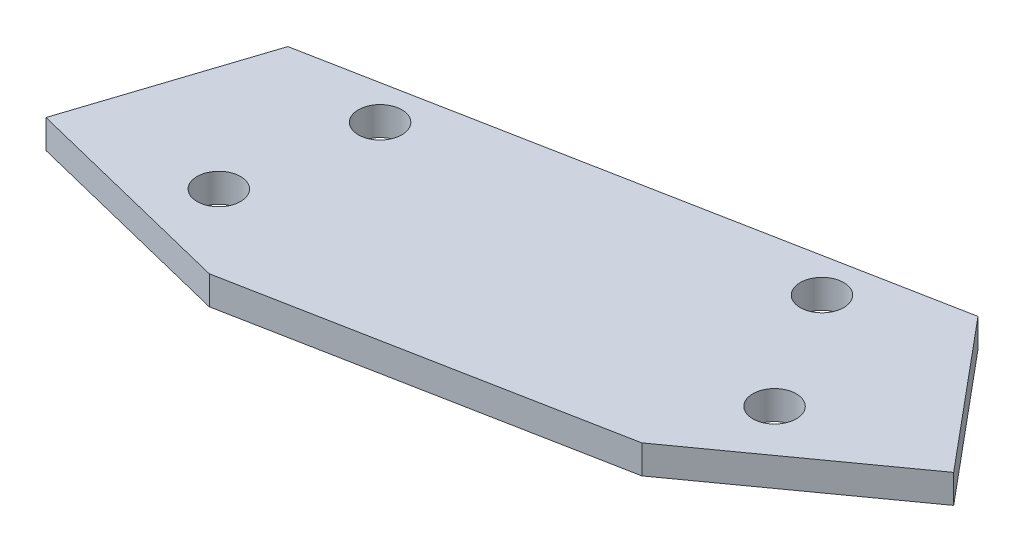
ISO-10303-21;
HEADER;
FILE_DESCRIPTION(('STEP AP214'),'2;1');
FILE_NAME('part.step','',(''),(''),'','','');
FILE_SCHEMA(('AUTOMOTIVE_DESIGN { 1 0 10303 214 1 1 1 1 }'));
ENDSEC;
DATA;
#1=APPLICATION_CONTEXT('core data for automotive mechanical design processes');
#2=APPLICATION_PROTOCOL_DEFINITION('international standard','automotive_design',2000,#1);
#3=PRODUCT_CONTEXT('',#1,'mechanical');
#4=PRODUCT('Part','Part','',(#3));
#5=PRODUCT_RELATED_PRODUCT_CATEGORY('part','',(#4));
#6=PRODUCT_DEFINITION_FORMATION('','',#4);
#7=PRODUCT_DEFINITION_CONTEXT('part definition',#1,'design');
#8=PRODUCT_DEFINITION('design','',#6,#7);
#9=PRODUCT_DEFINITION_SHAPE('','',#8);
#10=(LENGTH_UNIT() NAMED_UNIT(*) SI_UNIT(.MILLI.,.METRE.));
#11=(NAMED_UNIT(*) PLANE_ANGLE_UNIT() SI_UNIT($,.RADIAN.));
#12=(NAMED_UNIT(*) SI_UNIT($,.STERADIAN.) SOLID_ANGLE_UNIT());
#13=UNCERTAINTY_MEASURE_WITH_UNIT(LENGTH_MEASURE(1.E-05),#10,'distance_accuracy_value','');
#14=(GEOMETRIC_REPRESENTATION_CONTEXT(3) GLOBAL_UNCERTAINTY_ASSIGNED_CONTEXT((#13)) GLOBAL_UNIT_ASSIGNED_CONTEXT((#10,
#11,#12)) REPRESENTATION_CONTEXT('',''));
#15=CARTESIAN_POINT('',(0.,0.,0.));
#16=DIRECTION('',(0.,0.,1.));
#17=DIRECTION('',(1.,0.,0.));
#18=AXIS2_PLACEMENT_3D('',#15,#16,#17);
#19=CARTESIAN_POINT('',(0.,2.,0.));
#20=DIRECTION('',(0.,1.,0.));
#21=DIRECTION('',(0.,0.,1.));
#22=AXIS2_PLACEMENT_3D('',#19,#20,#21);
#23=PLANE('',#22);
#24=CARTESIAN_POINT('',(150.849906033684,2.,-17.2786141740151));
#25=DIRECTION('',(0.,1.,0.));
#26=DIRECTION('',(0.,0.,1.));
#27=AXIS2_PLACEMENT_3D('',#24,#25,#26);
#28=CIRCLE('',#27,1.51999999999999);
#29=CARTESIAN_POINT('',(150.849906033684,2.,-15.7586141740151));
#30=VERTEX_POINT('',#29);
#31=EDGE_CURVE('E195',#30,#30,#28,.T.);
#32=ORIENTED_EDGE('',*,*,#31,.F.);
#33=EDGE_LOOP('',(#32));
#34=FACE_BOUND('',#33,.T.);
#35=CARTESIAN_POINT('',(124.942788746776,2.,-12.2924783071056));
#36=DIRECTION('',(0.,1.,0.));
#37=DIRECTION('',(0.,0.,1.));
#38=AXIS2_PLACEMENT_3D('',#35,#36,#37);
#39=CIRCLE('',#38,1.51999999999996);
#40=CARTESIAN_POINT('',(124.942788746776,2.,-10.7724783071057));
#41=VERTEX_POINT('',#40);
#42=EDGE_CURVE('E128',#41,#41,#39,.T.);
#43=ORIENTED_EDGE('',*,*,#42,.F.);
#44=EDGE_LOOP('',(#43));
#45=FACE_BOUND('',#44,.T.);
#46=DIRECTION('',(-0.310146416397832,0.,0.950688803129385));
#47=VECTOR('',#46,1.);
#48=CARTESIAN_POINT('',(112.97357635398,2.,-0.902501231946934));
#49=LINE('',#48,#47);
#50=CARTESIAN_POINT('',(117.133278722941,2.,-13.6531965727238));
#51=VERTEX_POINT('',#50);
#52=CARTESIAN_POINT('',(112.97357635398,2.,-0.902501231946934));
#53=VERTEX_POINT('',#52);
#54=EDGE_CURVE('E135',#51,#53,#49,.T.);
#55=ORIENTED_EDGE('',*,*,#54,.T.);
#56=DIRECTION('',(0.970739827228978,0.,0.240133687414854));
#57=VECTOR('',#56,1.);
#58=CARTESIAN_POINT('',(128.142526141823,2.,2.84986963467687));
#59=LINE('',#58,#57);
#60=CARTESIAN_POINT('',(128.142526141823,2.,2.84986963467687));
#61=VERTEX_POINT('',#60);
#62=EDGE_CURVE('E93',#53,#61,#59,.T.);
#63=ORIENTED_EDGE('',*,*,#62,.T.);
#64=DIRECTION('',(0.981978333734859,0.,-0.188993523897807));
#65=VECTOR('',#64,1.);
#66=CARTESIAN_POINT('',(153.499211008062,2.,-2.03032890189353));
#67=LINE('',#66,#65);
#68=CARTESIAN_POINT('',(153.499211008062,2.,-2.03032890189353));
#69=VERTEX_POINT('',#68);
#70=EDGE_CURVE('E106',#61,#69,#67,.T.);
#71=ORIENTED_EDGE('',*,*,#70,.T.);
#72=DIRECTION('',(0.812261341145016,0.,-0.583293677045534));
#73=VECTOR('',#72,1.);
#74=CARTESIAN_POINT('',(166.191748341783,2.,-11.1449775961032));
#75=LINE('',#74,#73);
#76=CARTESIAN_POINT('',(166.191748341783,2.,-11.1449775961032));
#77=VERTEX_POINT('',#76);
#78=EDGE_CURVE('E100',#69,#77,#75,.T.);
#79=ORIENTED_EDGE('',*,*,#78,.T.);
#80=DIRECTION('',(-0.640862458670028,0.,-0.767655723008307));
#81=VECTOR('',#80,1.);
#82=CARTESIAN_POINT('',(157.596462545901,2.,-21.4408222704729));
#83=LINE('',#82,#81);
#84=CARTESIAN_POINT('',(157.596462545901,2.,-21.4408222704729));
#85=VERTEX_POINT('',#84);
#86=EDGE_CURVE('E104',#77,#85,#83,.T.);
#87=ORIENTED_EDGE('',*,*,#86,.T.);
#88=DIRECTION('',(-0.981978333699997,0.,0.188993524078939));
#89=VECTOR('',#88,1.);
#90=CARTESIAN_POINT('',(117.133278722941,2.,-13.6531965727238));
#91=LINE('',#90,#89);
#92=EDGE_CURVE('E56',#85,#51,#91,.T.);
#93=ORIENTED_EDGE('',*,*,#92,.T.);
#94=EDGE_LOOP('',(#55,#63,#71,#79,#87,#93));
#95=FACE_BOUND('',#94,.T.);
#96=CARTESIAN_POINT('',(123.343028663491,2.,-2.614316013658));
#97=DIRECTION('',(0.,1.,0.));
#98=DIRECTION('',(0.,0.,1.));
#99=AXIS2_PLACEMENT_3D('',#96,#97,#98);
#100=CIRCLE('',#99,1.52);
#101=CARTESIAN_POINT('',(123.343028663491,2.,-1.09431601365799));
#102=VERTEX_POINT('',#101);
#103=EDGE_CURVE('E201',#102,#102,#100,.T.);
#104=ORIENTED_EDGE('',*,*,#103,.F.);
#105=EDGE_LOOP('',(#104));
#106=FACE_BOUND('',#105,.T.);
#107=CARTESIAN_POINT('',(155.927676671118,2.,-8.88562286840841));
#108=DIRECTION('',(0.,1.,0.));
#109=DIRECTION('',(0.,0.,1.));
#110=AXIS2_PLACEMENT_3D('',#107,#108,#109);
#111=CIRCLE('',#110,1.52000000000002);
#112=CARTESIAN_POINT('',(155.927676671118,2.,-7.36562286840839));
#113=VERTEX_POINT('',#112);
#114=EDGE_CURVE('E186',#113,#113,#111,.T.);
#115=ORIENTED_EDGE('',*,*,#114,.F.);
#116=EDGE_LOOP('',(#115));
#117=FACE_BOUND('',#116,.T.);
#118=ADVANCED_FACE('F39',(#34,#45,#95,#106,#117),#23,.T.);
#119=CARTESIAN_POINT('',(0.,0.,0.));
#120=DIRECTION('',(0.,1.,0.));
#121=DIRECTION('',(0.,0.,1.));
#122=AXIS2_PLACEMENT_3D('',#119,#120,#121);
#123=PLANE('',#122);
#124=DIRECTION('',(-0.310146416397832,0.,0.950688803129385));
#125=VECTOR('',#124,1.);
#126=CARTESIAN_POINT('',(112.97357635398,0.,-0.902501231946934));
#127=LINE('',#126,#125);
#128=CARTESIAN_POINT('',(117.133278722941,0.,-13.6531965727238));
#129=VERTEX_POINT('',#128);
#130=CARTESIAN_POINT('',(112.97357635398,0.,-0.902501231946934));
#131=VERTEX_POINT('',#130);
#132=EDGE_CURVE('E124',#129,#131,#127,.T.);
#133=ORIENTED_EDGE('',*,*,#132,.F.);
#134=DIRECTION('',(-0.981978333699997,0.,0.188993524078939));
#135=VECTOR('',#134,1.);
#136=CARTESIAN_POINT('',(117.133278722941,0.,-13.6531965727238));
#137=LINE('',#136,#135);
#138=CARTESIAN_POINT('',(157.596462545901,0.,-21.4408222704729));
#139=VERTEX_POINT('',#138);
#140=EDGE_CURVE('E85',#139,#129,#137,.T.);
#141=ORIENTED_EDGE('',*,*,#140,.F.);
#142=DIRECTION('',(-0.640862458670028,0.,-0.767655723008307));
#143=VECTOR('',#142,1.);
#144=CARTESIAN_POINT('',(157.596462545901,0.,-21.4408222704729));
#145=LINE('',#144,#143);
#146=CARTESIAN_POINT('',(166.191748341783,0.,-11.1449775961032));
#147=VERTEX_POINT('',#146);
#148=EDGE_CURVE('E79',#147,#139,#145,.T.);
#149=ORIENTED_EDGE('',*,*,#148,.F.);
#150=DIRECTION('',(0.812261341145016,0.,-0.583293677045534));
#151=VECTOR('',#150,1.);
#152=CARTESIAN_POINT('',(166.191748341783,0.,-11.1449775961032));
#153=LINE('',#152,#151);
#154=CARTESIAN_POINT('',(153.499211008062,0.,-2.03032890189353));
#155=VERTEX_POINT('',#154);
#156=EDGE_CURVE('E114',#155,#147,#153,.T.);
#157=ORIENTED_EDGE('',*,*,#156,.F.);
#158=DIRECTION('',(0.981978333734859,0.,-0.188993523897807));
#159=VECTOR('',#158,1.);
#160=CARTESIAN_POINT('',(153.499211008062,0.,-2.03032890189353));
#161=LINE('',#160,#159);
#162=CARTESIAN_POINT('',(128.142526141823,0.,2.84986963467687));
#163=VERTEX_POINT('',#162);
#164=EDGE_CURVE('E130',#163,#155,#161,.T.);
#165=ORIENTED_EDGE('',*,*,#164,.F.);
#166=DIRECTION('',(0.970739827228978,0.,0.240133687414854));
#167=VECTOR('',#166,1.);
#168=CARTESIAN_POINT('',(128.142526141823,0.,2.84986963467687));
#169=LINE('',#168,#167);
#170=EDGE_CURVE('E127',#131,#163,#169,.T.);
#171=ORIENTED_EDGE('',*,*,#170,.F.);
#172=EDGE_LOOP('',(#133,#141,#149,#157,#165,#171));
#173=FACE_BOUND('',#172,.T.);
#174=CARTESIAN_POINT('',(124.942788746776,0.,-12.2924783071056));
#175=DIRECTION('',(0.,1.,0.));
#176=DIRECTION('',(0.,0.,1.));
#177=AXIS2_PLACEMENT_3D('',#174,#175,#176);
#178=CIRCLE('',#177,1.51999999999996);
#179=CARTESIAN_POINT('',(124.942788746776,0.,-10.7724783071057));
#180=VERTEX_POINT('',#179);
#181=EDGE_CURVE('E204',#180,#180,#178,.T.);
#182=ORIENTED_EDGE('',*,*,#181,.T.);
#183=EDGE_LOOP('',(#182));
#184=FACE_BOUND('',#183,.T.);
#185=CARTESIAN_POINT('',(123.343028663491,0.,-2.614316013658));
#186=DIRECTION('',(0.,1.,0.));
#187=DIRECTION('',(0.,0.,1.));
#188=AXIS2_PLACEMENT_3D('',#185,#186,#187);
#189=CIRCLE('',#188,1.52);
#190=CARTESIAN_POINT('',(123.343028663491,0.,-1.09431601365799));
#191=VERTEX_POINT('',#190);
#192=EDGE_CURVE('E198',#191,#191,#189,.T.);
#193=ORIENTED_EDGE('',*,*,#192,.T.);
#194=EDGE_LOOP('',(#193));
#195=FACE_BOUND('',#194,.T.);
#196=CARTESIAN_POINT('',(150.849906033684,0.,-17.2786141740151));
#197=DIRECTION('',(0.,1.,0.));
#198=DIRECTION('',(0.,0.,1.));
#199=AXIS2_PLACEMENT_3D('',#196,#197,#198);
#200=CIRCLE('',#199,1.51999999999999);
#201=CARTESIAN_POINT('',(150.849906033684,0.,-15.7586141740151));
#202=VERTEX_POINT('',#201);
#203=EDGE_CURVE('E192',#202,#202,#200,.T.);
#204=ORIENTED_EDGE('',*,*,#203,.T.);
#205=EDGE_LOOP('',(#204));
#206=FACE_BOUND('',#205,.T.);
#207=CARTESIAN_POINT('',(155.927676671118,0.,-8.88562286840841));
#208=DIRECTION('',(0.,1.,0.));
#209=DIRECTION('',(0.,0.,1.));
#210=AXIS2_PLACEMENT_3D('',#207,#208,#209);
#211=CIRCLE('',#210,1.52000000000002);
#212=CARTESIAN_POINT('',(155.927676671118,0.,-7.36562286840839));
#213=VERTEX_POINT('',#212);
#214=EDGE_CURVE('E189',#213,#213,#211,.T.);
#215=ORIENTED_EDGE('',*,*,#214,.T.);
#216=EDGE_LOOP('',(#215));
#217=FACE_BOUND('',#216,.T.);
#218=ADVANCED_FACE('F144',(#173,#184,#195,#206,#217),#123,.F.);
#219=CARTESIAN_POINT('',(112.97357635398,2.,-0.902501231946934));
#220=DIRECTION('',(0.950688803129385,0.,0.310146416397832));
#221=DIRECTION('',(0.310146416397832,0.,-0.950688803129385));
#222=AXIS2_PLACEMENT_3D('',#219,#220,#221);
#223=PLANE('',#222);
#224=ORIENTED_EDGE('',*,*,#132,.T.);
#225=DIRECTION('',(0.,-1.,0.));
#226=VECTOR('',#225,1.);
#227=CARTESIAN_POINT('',(112.97357635398,2.,-0.902501231946934));
#228=LINE('',#227,#226);
#229=EDGE_CURVE('E11',#53,#131,#228,.T.);
#230=ORIENTED_EDGE('',*,*,#229,.F.);
#231=ORIENTED_EDGE('',*,*,#54,.F.);
#232=DIRECTION('',(0.,-1.,0.));
#233=VECTOR('',#232,1.);
#234=CARTESIAN_POINT('',(117.133278722941,2.,-13.6531965727238));
#235=LINE('',#234,#233);
#236=EDGE_CURVE('E120',#51,#129,#235,.T.);
#237=ORIENTED_EDGE('',*,*,#236,.T.);
#238=EDGE_LOOP('',(#224,#230,#231,#237));
#239=FACE_BOUND('',#238,.T.);
#240=ADVANCED_FACE('F41',(#239),#223,.F.);
#241=CARTESIAN_POINT('',(128.142526141823,2.,2.84986963467687));
#242=DIRECTION('',(0.240133687414854,0.,-0.970739827228978));
#243=DIRECTION('',(-0.970739827228978,0.,-0.240133687414854));
#244=AXIS2_PLACEMENT_3D('',#241,#242,#243);
#245=PLANE('',#244);
#246=ORIENTED_EDGE('',*,*,#170,.T.);
#247=DIRECTION('',(0.,-1.,0.));
#248=VECTOR('',#247,1.);
#249=CARTESIAN_POINT('',(128.142526141823,2.,2.84986963467687));
#250=LINE('',#249,#248);
#251=EDGE_CURVE('E48',#61,#163,#250,.T.);
#252=ORIENTED_EDGE('',*,*,#251,.F.);
#253=ORIENTED_EDGE('',*,*,#62,.F.);
#254=ORIENTED_EDGE('',*,*,#229,.T.);
#255=EDGE_LOOP('',(#246,#252,#253,#254));
#256=FACE_BOUND('',#255,.T.);
#257=ADVANCED_FACE('F266',(#256),#245,.F.);
#258=CARTESIAN_POINT('',(153.499211008062,2.,-2.03032890189353));
#259=DIRECTION('',(-0.188993523897806,0.,-0.981978333734858));
#260=DIRECTION('',(-0.981978333734859,0.,0.188993523897807));
#261=AXIS2_PLACEMENT_3D('',#258,#259,#260);
#262=PLANE('',#261);
#263=ORIENTED_EDGE('',*,*,#164,.T.);
#264=DIRECTION('',(0.,-1.,0.));
#265=VECTOR('',#264,1.);
#266=CARTESIAN_POINT('',(153.499211008062,2.,-2.03032890189353));
#267=LINE('',#266,#265);
#268=EDGE_CURVE('E115',#69,#155,#267,.T.);
#269=ORIENTED_EDGE('',*,*,#268,.F.);
#270=ORIENTED_EDGE('',*,*,#70,.F.);
#271=ORIENTED_EDGE('',*,*,#251,.T.);
#272=EDGE_LOOP('',(#263,#269,#270,#271));
#273=FACE_BOUND('',#272,.T.);
#274=ADVANCED_FACE('F141',(#273),#262,.F.);
#275=CARTESIAN_POINT('',(166.191748341783,2.,-11.1449775961032));
#276=DIRECTION('',(-0.583293677045534,0.,-0.812261341145016));
#277=DIRECTION('',(-0.812261341145016,0.,0.583293677045534));
#278=AXIS2_PLACEMENT_3D('',#275,#276,#277);
#279=PLANE('',#278);
#280=ORIENTED_EDGE('',*,*,#156,.T.);
#281=DIRECTION('',(0.,-1.,0.));
#282=VECTOR('',#281,1.);
#283=CARTESIAN_POINT('',(166.191748341783,2.,-11.1449775961032));
#284=LINE('',#283,#282);
#285=EDGE_CURVE('E111',#77,#147,#284,.T.);
#286=ORIENTED_EDGE('',*,*,#285,.F.);
#287=ORIENTED_EDGE('',*,*,#78,.F.);
#288=ORIENTED_EDGE('',*,*,#268,.T.);
#289=EDGE_LOOP('',(#280,#286,#287,#288));
#290=FACE_BOUND('',#289,.T.);
#291=ADVANCED_FACE('F112',(#290),#279,.F.);
#292=CARTESIAN_POINT('',(157.596462545901,2.,-21.4408222704729));
#293=DIRECTION('',(-0.767655723008307,0.,0.640862458670028));
#294=DIRECTION('',(0.640862458670028,0.,0.767655723008307));
#295=AXIS2_PLACEMENT_3D('',#292,#293,#294);
#296=PLANE('',#295);
#297=ORIENTED_EDGE('',*,*,#148,.T.);
#298=DIRECTION('',(0.,-1.,0.));
#299=VECTOR('',#298,1.);
#300=CARTESIAN_POINT('',(157.596462545901,2.,-21.4408222704729));
#301=LINE('',#300,#299);
#302=EDGE_CURVE('E116',#85,#139,#301,.T.);
#303=ORIENTED_EDGE('',*,*,#302,.F.);
#304=ORIENTED_EDGE('',*,*,#86,.F.);
#305=ORIENTED_EDGE('',*,*,#285,.T.);
#306=EDGE_LOOP('',(#297,#303,#304,#305));
#307=FACE_BOUND('',#306,.T.);
#308=ADVANCED_FACE('F118',(#307),#296,.F.);
#309=CARTESIAN_POINT('',(117.133278722941,2.,-13.6531965727238));
#310=DIRECTION('',(0.188993524078939,0.,0.981978333699997));
#311=DIRECTION('',(0.981978333699997,0.,-0.188993524078939));
#312=AXIS2_PLACEMENT_3D('',#309,#310,#311);
#313=PLANE('',#312);
#314=ORIENTED_EDGE('',*,*,#140,.T.);
#315=ORIENTED_EDGE('',*,*,#236,.F.);
#316=ORIENTED_EDGE('',*,*,#92,.F.);
#317=ORIENTED_EDGE('',*,*,#302,.T.);
#318=EDGE_LOOP('',(#314,#315,#316,#317));
#319=FACE_BOUND('',#318,.T.);
#320=ADVANCED_FACE('F149',(#319),#313,.F.);
#321=CARTESIAN_POINT('',(124.942788746776,2.,-12.2924783071056));
#322=DIRECTION('',(0.,-1.,0.));
#323=DIRECTION('',(0.,0.,-1.));
#324=AXIS2_PLACEMENT_3D('',#321,#322,#323);
#325=CYLINDRICAL_SURFACE('',#324,1.51999999999996);
#326=ORIENTED_EDGE('',*,*,#42,.T.);
#327=EDGE_LOOP('',(#326));
#328=FACE_BOUND('',#327,.T.);
#329=ORIENTED_EDGE('',*,*,#181,.F.);
#330=EDGE_LOOP('',(#329));
#331=FACE_BOUND('',#330,.T.);
#332=ADVANCED_FACE('F151',(#328,#331),#325,.F.);
#333=CARTESIAN_POINT('',(123.343028663491,2.,-2.614316013658));
#334=DIRECTION('',(0.,-1.,0.));
#335=DIRECTION('',(0.,0.,-1.));
#336=AXIS2_PLACEMENT_3D('',#333,#334,#335);
#337=CYLINDRICAL_SURFACE('',#336,1.52);
#338=ORIENTED_EDGE('',*,*,#103,.T.);
#339=EDGE_LOOP('',(#338));
#340=FACE_BOUND('',#339,.T.);
#341=ORIENTED_EDGE('',*,*,#192,.F.);
#342=EDGE_LOOP('',(#341));
#343=FACE_BOUND('',#342,.T.);
#344=ADVANCED_FACE('F157',(#340,#343),#337,.F.);
#345=CARTESIAN_POINT('',(150.849906033684,2.,-17.2786141740151));
#346=DIRECTION('',(0.,-1.,0.));
#347=DIRECTION('',(0.,0.,-1.));
#348=AXIS2_PLACEMENT_3D('',#345,#346,#347);
#349=CYLINDRICAL_SURFACE('',#348,1.51999999999999);
#350=ORIENTED_EDGE('',*,*,#31,.T.);
#351=EDGE_LOOP('',(#350));
#352=FACE_BOUND('',#351,.T.);
#353=ORIENTED_EDGE('',*,*,#203,.F.);
#354=EDGE_LOOP('',(#353));
#355=FACE_BOUND('',#354,.T.);
#356=ADVANCED_FACE('F173',(#352,#355),#349,.F.);
#357=CARTESIAN_POINT('',(155.927676671118,2.,-8.88562286840841));
#358=DIRECTION('',(0.,-1.,0.));
#359=DIRECTION('',(0.,0.,-1.));
#360=AXIS2_PLACEMENT_3D('',#357,#358,#359);
#361=CYLINDRICAL_SURFACE('',#360,1.52000000000002);
#362=ORIENTED_EDGE('',*,*,#114,.T.);
#363=EDGE_LOOP('',(#362));
#364=FACE_BOUND('',#363,.T.);
#365=ORIENTED_EDGE('',*,*,#214,.F.);
#366=EDGE_LOOP('',(#365));
#367=FACE_BOUND('',#366,.T.);
#368=ADVANCED_FACE('F177',(#364,#367),#361,.F.);
#369=CLOSED_SHELL('',(#118,#218,#240,#257,#274,#291,#308,#320,#332,#344,#356,#368));
#370=MANIFOLD_SOLID_BREP('B2',#369);
#371=ADVANCED_BREP_SHAPE_REPRESENTATION('',(#18,#370),#14);
#372=SHAPE_DEFINITION_REPRESENTATION(#9,#371);
ENDSEC;
END-ISO-10303-21;
